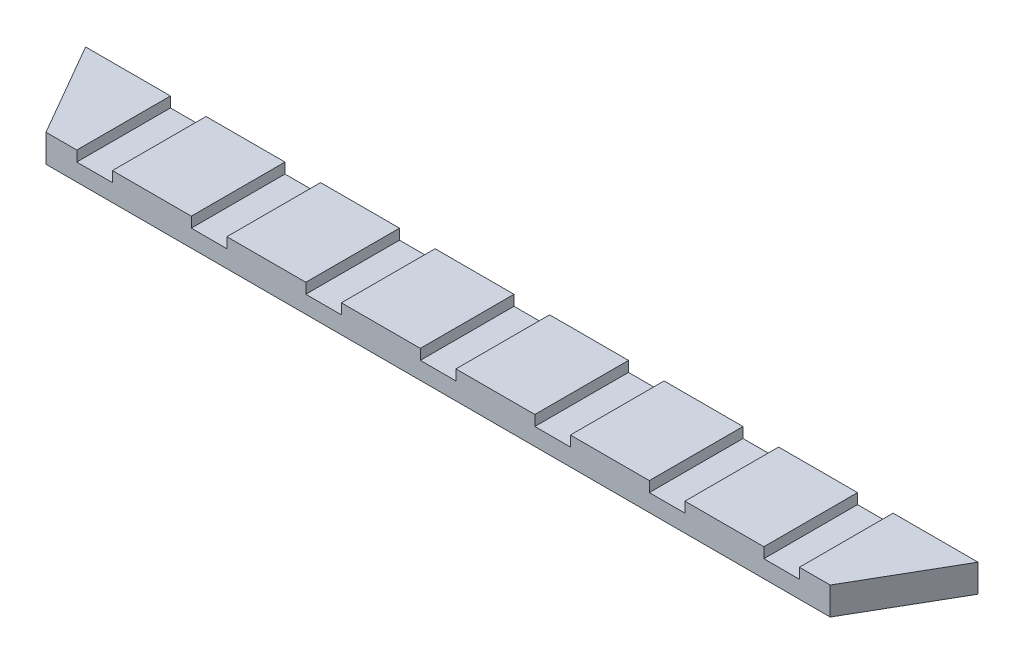
ISO-10303-21;
HEADER;
FILE_DESCRIPTION(('STEP AP214'),'2;1');
FILE_NAME('part.step','',(''),(''),'','','');
FILE_SCHEMA(('AUTOMOTIVE_DESIGN { 1 0 10303 214 1 1 1 1 }'));
ENDSEC;
DATA;
#1=APPLICATION_CONTEXT('core data for automotive mechanical design processes');
#2=APPLICATION_PROTOCOL_DEFINITION('international standard','automotive_design',2000,#1);
#3=PRODUCT_CONTEXT('',#1,'mechanical');
#4=PRODUCT('Part','Part','',(#3));
#5=PRODUCT_RELATED_PRODUCT_CATEGORY('part','',(#4));
#6=PRODUCT_DEFINITION_FORMATION('','',#4);
#7=PRODUCT_DEFINITION_CONTEXT('part definition',#1,'design');
#8=PRODUCT_DEFINITION('design','',#6,#7);
#9=PRODUCT_DEFINITION_SHAPE('','',#8);
#10=(LENGTH_UNIT() NAMED_UNIT(*) SI_UNIT(.MILLI.,.METRE.));
#11=(NAMED_UNIT(*) PLANE_ANGLE_UNIT() SI_UNIT($,.RADIAN.));
#12=(NAMED_UNIT(*) SI_UNIT($,.STERADIAN.) SOLID_ANGLE_UNIT());
#13=UNCERTAINTY_MEASURE_WITH_UNIT(LENGTH_MEASURE(1.E-05),#10,'distance_accuracy_value','');
#14=(GEOMETRIC_REPRESENTATION_CONTEXT(3) GLOBAL_UNCERTAINTY_ASSIGNED_CONTEXT((#13)) GLOBAL_UNIT_ASSIGNED_CONTEXT((#10,
#11,#12)) REPRESENTATION_CONTEXT('',''));
#15=CARTESIAN_POINT('',(0.,0.,0.));
#16=DIRECTION('',(0.,0.,1.));
#17=DIRECTION('',(1.,0.,0.));
#18=AXIS2_PLACEMENT_3D('',#15,#16,#17);
#19=CARTESIAN_POINT('',(0.,8.,0.));
#20=DIRECTION('',(0.,-1.,0.));
#21=DIRECTION('',(0.,0.,-1.));
#22=AXIS2_PLACEMENT_3D('',#19,#20,#21);
#23=PLANE('',#22);
#24=DIRECTION('',(-1.,0.,0.));
#25=VECTOR('',#24,1.);
#26=CARTESIAN_POINT('',(-128.58845726812,8.,-14.3710853800687));
#27=LINE('',#26,#25);
#28=CARTESIAN_POINT('',(-71.1291173685713,8.,-14.3710853800687));
#29=VERTEX_POINT('',#28);
#30=CARTESIAN_POINT('',(-93.8708826314287,8.,-14.3710853800687));
#31=VERTEX_POINT('',#30);
#32=EDGE_CURVE('E523',#29,#31,#27,.T.);
#33=ORIENTED_EDGE('',*,*,#32,.T.);
#34=DIRECTION('',(0.,0.,-1.));
#35=VECTOR('',#34,1.);
#36=CARTESIAN_POINT('',(-93.8708826314287,8.,-14.3710853800687));
#37=LINE('',#36,#35);
#38=CARTESIAN_POINT('',(-93.8708826314287,8.,12.6289146199313));
#39=VERTEX_POINT('',#38);
#40=EDGE_CURVE('E246',#39,#31,#37,.T.);
#41=ORIENTED_EDGE('',*,*,#40,.F.);
#42=DIRECTION('',(1.,0.,0.));
#43=VECTOR('',#42,1.);
#44=CARTESIAN_POINT('',(-113.,8.,12.6289146199313));
#45=LINE('',#44,#43);
#46=CARTESIAN_POINT('',(-71.1291173685713,8.,12.6289146199313));
#47=VERTEX_POINT('',#46);
#48=EDGE_CURVE('E449',#39,#47,#45,.T.);
#49=ORIENTED_EDGE('',*,*,#48,.T.);
#50=DIRECTION('',(0.,0.,1.));
#51=VECTOR('',#50,1.);
#52=CARTESIAN_POINT('',(-71.1291173685713,8.,-14.3710853800687));
#53=LINE('',#52,#51);
#54=EDGE_CURVE('E283',#29,#47,#53,.T.);
#55=ORIENTED_EDGE('',*,*,#54,.F.);
#56=EDGE_LOOP('',(#33,#41,#49,#55));
#57=FACE_BOUND('',#56,.T.);
#58=ADVANCED_FACE('F32',(#57),#23,.F.);
#59=CARTESIAN_POINT('',(-38.1291173685713,8.,-14.3710853800687));
#60=VERTEX_POINT('',#59);
#61=CARTESIAN_POINT('',(-60.8708826314287,8.,-14.3710853800687));
#62=VERTEX_POINT('',#61);
#63=EDGE_CURVE('E524',#60,#62,#27,.T.);
#64=ORIENTED_EDGE('',*,*,#63,.T.);
#65=DIRECTION('',(0.,0.,-1.));
#66=VECTOR('',#65,1.);
#67=CARTESIAN_POINT('',(-60.8708826314287,8.,-14.3710853800687));
#68=LINE('',#67,#66);
#69=CARTESIAN_POINT('',(-60.8708826314287,8.,12.6289146199313));
#70=VERTEX_POINT('',#69);
#71=EDGE_CURVE('E293',#70,#62,#68,.T.);
#72=ORIENTED_EDGE('',*,*,#71,.F.);
#73=CARTESIAN_POINT('',(-38.1291173685713,8.,12.6289146199313));
#74=VERTEX_POINT('',#73);
#75=EDGE_CURVE('E505',#70,#74,#45,.T.);
#76=ORIENTED_EDGE('',*,*,#75,.T.);
#77=DIRECTION('',(0.,0.,1.));
#78=VECTOR('',#77,1.);
#79=CARTESIAN_POINT('',(-38.1291173685713,8.,-14.3710853800687));
#80=LINE('',#79,#78);
#81=EDGE_CURVE('E308',#60,#74,#80,.T.);
#82=ORIENTED_EDGE('',*,*,#81,.F.);
#83=EDGE_LOOP('',(#64,#72,#76,#82));
#84=FACE_BOUND('',#83,.T.);
#85=ADVANCED_FACE('F539',(#84),#23,.F.);
#86=CARTESIAN_POINT('',(-5.1291173685713,8.,-14.3710853800687));
#87=VERTEX_POINT('',#86);
#88=CARTESIAN_POINT('',(-27.8708826314287,8.,-14.3710853800687));
#89=VERTEX_POINT('',#88);
#90=EDGE_CURVE('E526',#87,#89,#27,.T.);
#91=ORIENTED_EDGE('',*,*,#90,.T.);
#92=DIRECTION('',(0.,0.,-1.));
#93=VECTOR('',#92,1.);
#94=CARTESIAN_POINT('',(-27.8708826314287,8.,-14.3710853800687));
#95=LINE('',#94,#93);
#96=CARTESIAN_POINT('',(-27.8708826314287,8.,12.6289146199313));
#97=VERTEX_POINT('',#96);
#98=EDGE_CURVE('E318',#97,#89,#95,.T.);
#99=ORIENTED_EDGE('',*,*,#98,.F.);
#100=CARTESIAN_POINT('',(-5.1291173685713,8.,12.6289146199313));
#101=VERTEX_POINT('',#100);
#102=EDGE_CURVE('E499',#97,#101,#45,.T.);
#103=ORIENTED_EDGE('',*,*,#102,.T.);
#104=DIRECTION('',(0.,0.,1.));
#105=VECTOR('',#104,1.);
#106=CARTESIAN_POINT('',(-5.1291173685713,8.,-14.3710853800687));
#107=LINE('',#106,#105);
#108=EDGE_CURVE('E334',#87,#101,#107,.T.);
#109=ORIENTED_EDGE('',*,*,#108,.F.);
#110=EDGE_LOOP('',(#91,#99,#103,#109));
#111=FACE_BOUND('',#110,.T.);
#112=ADVANCED_FACE('F545',(#111),#23,.F.);
#113=CARTESIAN_POINT('',(27.8708826314287,8.,-14.3710853800687));
#114=VERTEX_POINT('',#113);
#115=CARTESIAN_POINT('',(5.1291173685713,8.,-14.3710853800687));
#116=VERTEX_POINT('',#115);
#117=EDGE_CURVE('E573',#114,#116,#27,.T.);
#118=ORIENTED_EDGE('',*,*,#117,.T.);
#119=DIRECTION('',(0.,0.,-1.));
#120=VECTOR('',#119,1.);
#121=CARTESIAN_POINT('',(5.1291173685713,8.,-14.3710853800687));
#122=LINE('',#121,#120);
#123=CARTESIAN_POINT('',(5.1291173685713,8.,12.6289146199313));
#124=VERTEX_POINT('',#123);
#125=EDGE_CURVE('E344',#124,#116,#122,.T.);
#126=ORIENTED_EDGE('',*,*,#125,.F.);
#127=CARTESIAN_POINT('',(27.8708826314287,8.,12.6289146199313));
#128=VERTEX_POINT('',#127);
#129=EDGE_CURVE('E493',#124,#128,#45,.T.);
#130=ORIENTED_EDGE('',*,*,#129,.T.);
#131=DIRECTION('',(0.,0.,1.));
#132=VECTOR('',#131,1.);
#133=CARTESIAN_POINT('',(27.8708826314287,8.,-14.3710853800687));
#134=LINE('',#133,#132);
#135=EDGE_CURVE('E360',#114,#128,#134,.T.);
#136=ORIENTED_EDGE('',*,*,#135,.F.);
#137=EDGE_LOOP('',(#118,#126,#130,#136));
#138=FACE_BOUND('',#137,.T.);
#139=ADVANCED_FACE('F567',(#138),#23,.F.);
#140=CARTESIAN_POINT('',(60.8708826314287,8.,-14.3710853800687));
#141=VERTEX_POINT('',#140);
#142=CARTESIAN_POINT('',(38.1291173685713,8.,-14.3710853800687));
#143=VERTEX_POINT('',#142);
#144=EDGE_CURVE('E571',#141,#143,#27,.T.);
#145=ORIENTED_EDGE('',*,*,#144,.T.);
#146=DIRECTION('',(0.,0.,-1.));
#147=VECTOR('',#146,1.);
#148=CARTESIAN_POINT('',(38.1291173685713,8.,-14.3710853800687));
#149=LINE('',#148,#147);
#150=CARTESIAN_POINT('',(38.1291173685713,8.,12.6289146199313));
#151=VERTEX_POINT('',#150);
#152=EDGE_CURVE('E370',#151,#143,#149,.T.);
#153=ORIENTED_EDGE('',*,*,#152,.F.);
#154=CARTESIAN_POINT('',(60.8708826314287,8.,12.6289146199313));
#155=VERTEX_POINT('',#154);
#156=EDGE_CURVE('E487',#151,#155,#45,.T.);
#157=ORIENTED_EDGE('',*,*,#156,.T.);
#158=DIRECTION('',(0.,0.,1.));
#159=VECTOR('',#158,1.);
#160=CARTESIAN_POINT('',(60.8708826314287,8.,-14.3710853800687));
#161=LINE('',#160,#159);
#162=EDGE_CURVE('E386',#141,#155,#161,.T.);
#163=ORIENTED_EDGE('',*,*,#162,.F.);
#164=EDGE_LOOP('',(#145,#153,#157,#163));
#165=FACE_BOUND('',#164,.T.);
#166=ADVANCED_FACE('F563',(#165),#23,.F.);
#167=CARTESIAN_POINT('',(93.8708826314287,8.,-14.3710853800687));
#168=VERTEX_POINT('',#167);
#169=CARTESIAN_POINT('',(71.1291173685713,8.,-14.3710853800687));
#170=VERTEX_POINT('',#169);
#171=EDGE_CURVE('E442',#168,#170,#27,.T.);
#172=ORIENTED_EDGE('',*,*,#171,.T.);
#173=DIRECTION('',(0.,0.,-1.));
#174=VECTOR('',#173,1.);
#175=CARTESIAN_POINT('',(71.1291173685713,8.,-14.3710853800687));
#176=LINE('',#175,#174);
#177=CARTESIAN_POINT('',(71.1291173685713,8.,12.6289146199313));
#178=VERTEX_POINT('',#177);
#179=EDGE_CURVE('E396',#178,#170,#176,.T.);
#180=ORIENTED_EDGE('',*,*,#179,.F.);
#181=CARTESIAN_POINT('',(93.8708826314287,8.,12.6289146199313));
#182=VERTEX_POINT('',#181);
#183=EDGE_CURVE('E485',#178,#182,#45,.T.);
#184=ORIENTED_EDGE('',*,*,#183,.T.);
#185=DIRECTION('',(0.,0.,1.));
#186=VECTOR('',#185,1.);
#187=CARTESIAN_POINT('',(93.8708826314287,8.,-14.3710853800687));
#188=LINE('',#187,#186);
#189=EDGE_CURVE('E412',#168,#182,#188,.T.);
#190=ORIENTED_EDGE('',*,*,#189,.F.);
#191=EDGE_LOOP('',(#172,#180,#184,#190));
#192=FACE_BOUND('',#191,.T.);
#193=ADVANCED_FACE('F557',(#192),#23,.F.);
#194=CARTESIAN_POINT('',(128.58845726812,8.,-14.3710853800687));
#195=VERTEX_POINT('',#194);
#196=CARTESIAN_POINT('',(104.129117368571,8.,-14.3710853800687));
#197=VERTEX_POINT('',#196);
#198=EDGE_CURVE('E438',#195,#197,#27,.T.);
#199=ORIENTED_EDGE('',*,*,#198,.T.);
#200=DIRECTION('',(0.,0.,-1.));
#201=VECTOR('',#200,1.);
#202=CARTESIAN_POINT('',(104.129117368571,8.,-14.3710853800687));
#203=LINE('',#202,#201);
#204=CARTESIAN_POINT('',(104.129117368571,8.,12.6289146199313));
#205=VERTEX_POINT('',#204);
#206=EDGE_CURVE('E422',#205,#197,#203,.T.);
#207=ORIENTED_EDGE('',*,*,#206,.F.);
#208=CARTESIAN_POINT('',(113.,8.,12.6289146199313));
#209=VERTEX_POINT('',#208);
#210=EDGE_CURVE('E444',#205,#209,#45,.T.);
#211=ORIENTED_EDGE('',*,*,#210,.T.);
#212=DIRECTION('',(0.499999999999998,0.,-0.86602540378444));
#213=VECTOR('',#212,1.);
#214=CARTESIAN_POINT('',(113.,8.,12.6289146199313));
#215=LINE('',#214,#213);
#216=EDGE_CURVE('E433',#209,#195,#215,.T.);
#217=ORIENTED_EDGE('',*,*,#216,.T.);
#218=EDGE_LOOP('',(#199,#207,#211,#217));
#219=FACE_BOUND('',#218,.T.);
#220=ADVANCED_FACE('F482',(#219),#23,.F.);
#221=CARTESIAN_POINT('',(113.,8.,12.6289146199313));
#222=DIRECTION('',(-0.86602540378444,0.,-0.499999999999998));
#223=DIRECTION('',(-0.499999999999998,0.,0.86602540378444));
#224=AXIS2_PLACEMENT_3D('',#221,#222,#223);
#225=PLANE('',#224);
#226=DIRECTION('',(0.499999999999998,0.,-0.86602540378444));
#227=VECTOR('',#226,1.);
#228=CARTESIAN_POINT('',(113.,0.,12.6289146199313));
#229=LINE('',#228,#227);
#230=CARTESIAN_POINT('',(113.,0.,12.6289146199313));
#231=VERTEX_POINT('',#230);
#232=CARTESIAN_POINT('',(128.58845726812,0.,-14.3710853800687));
#233=VERTEX_POINT('',#232);
#234=EDGE_CURVE('E274',#231,#233,#229,.T.);
#235=ORIENTED_EDGE('',*,*,#234,.T.);
#236=DIRECTION('',(0.,-1.,0.));
#237=VECTOR('',#236,1.);
#238=CARTESIAN_POINT('',(128.58845726812,8.,-14.3710853800687));
#239=LINE('',#238,#237);
#240=EDGE_CURVE('E11',#195,#233,#239,.T.);
#241=ORIENTED_EDGE('',*,*,#240,.F.);
#242=ORIENTED_EDGE('',*,*,#216,.F.);
#243=DIRECTION('',(0.,-1.,0.));
#244=VECTOR('',#243,1.);
#245=CARTESIAN_POINT('',(113.,8.,12.6289146199313));
#246=LINE('',#245,#244);
#247=EDGE_CURVE('E448',#209,#231,#246,.T.);
#248=ORIENTED_EDGE('',*,*,#247,.T.);
#249=EDGE_LOOP('',(#235,#241,#242,#248));
#250=FACE_BOUND('',#249,.T.);
#251=ADVANCED_FACE('F34',(#250),#225,.F.);
#252=CARTESIAN_POINT('',(-128.58845726812,8.,-14.3710853800687));
#253=DIRECTION('',(0.,0.,1.));
#254=DIRECTION('',(1.,0.,0.));
#255=AXIS2_PLACEMENT_3D('',#252,#253,#254);
#256=PLANE('',#255);
#257=DIRECTION('',(-1.,0.,0.));
#258=VECTOR('',#257,1.);
#259=CARTESIAN_POINT('',(-104.129117368571,5.,-14.3710853800687));
#260=LINE('',#259,#258);
#261=CARTESIAN_POINT('',(-93.8708826314287,5.,-14.3710853800687));
#262=VERTEX_POINT('',#261);
#263=CARTESIAN_POINT('',(-104.129117368571,5.,-14.3710853800687));
#264=VERTEX_POINT('',#263);
#265=EDGE_CURVE('E257',#262,#264,#260,.T.);
#266=ORIENTED_EDGE('',*,*,#265,.F.);
#267=DIRECTION('',(0.,1.,0.));
#268=VECTOR('',#267,1.);
#269=CARTESIAN_POINT('',(-93.8708826314287,5.,-14.3710853800687));
#270=LINE('',#269,#268);
#271=EDGE_CURVE('E240',#262,#31,#270,.T.);
#272=ORIENTED_EDGE('',*,*,#271,.T.);
#273=ORIENTED_EDGE('',*,*,#32,.F.);
#274=DIRECTION('',(0.,1.,0.));
#275=VECTOR('',#274,1.);
#276=CARTESIAN_POINT('',(-71.1291173685713,5.,-14.3710853800687));
#277=LINE('',#276,#275);
#278=CARTESIAN_POINT('',(-71.1291173685713,5.,-14.3710853800687));
#279=VERTEX_POINT('',#278);
#280=EDGE_CURVE('E55',#279,#29,#277,.T.);
#281=ORIENTED_EDGE('',*,*,#280,.F.);
#282=DIRECTION('',(-1.,0.,0.));
#283=VECTOR('',#282,1.);
#284=CARTESIAN_POINT('',(-71.1291173685713,5.,-14.3710853800687));
#285=LINE('',#284,#283);
#286=CARTESIAN_POINT('',(-60.8708826314287,5.,-14.3710853800687));
#287=VERTEX_POINT('',#286);
#288=EDGE_CURVE('E282',#287,#279,#285,.T.);
#289=ORIENTED_EDGE('',*,*,#288,.F.);
#290=DIRECTION('',(0.,1.,0.));
#291=VECTOR('',#290,1.);
#292=CARTESIAN_POINT('',(-60.8708826314287,5.,-14.3710853800687));
#293=LINE('',#292,#291);
#294=EDGE_CURVE('E292',#287,#62,#293,.T.);
#295=ORIENTED_EDGE('',*,*,#294,.T.);
#296=ORIENTED_EDGE('',*,*,#63,.F.);
#297=DIRECTION('',(0.,1.,0.));
#298=VECTOR('',#297,1.);
#299=CARTESIAN_POINT('',(-38.1291173685713,5.,-14.3710853800687));
#300=LINE('',#299,#298);
#301=CARTESIAN_POINT('',(-38.1291173685713,5.,-14.3710853800687));
#302=VERTEX_POINT('',#301);
#303=EDGE_CURVE('E326',#302,#60,#300,.T.);
#304=ORIENTED_EDGE('',*,*,#303,.F.);
#305=DIRECTION('',(-1.,0.,0.));
#306=VECTOR('',#305,1.);
#307=CARTESIAN_POINT('',(-38.1291173685713,5.,-14.3710853800687));
#308=LINE('',#307,#306);
#309=CARTESIAN_POINT('',(-27.8708826314287,5.,-14.3710853800687));
#310=VERTEX_POINT('',#309);
#311=EDGE_CURVE('E307',#310,#302,#308,.T.);
#312=ORIENTED_EDGE('',*,*,#311,.F.);
#313=DIRECTION('',(0.,1.,0.));
#314=VECTOR('',#313,1.);
#315=CARTESIAN_POINT('',(-27.8708826314287,5.,-14.3710853800687));
#316=LINE('',#315,#314);
#317=EDGE_CURVE('E317',#310,#89,#316,.T.);
#318=ORIENTED_EDGE('',*,*,#317,.T.);
#319=ORIENTED_EDGE('',*,*,#90,.F.);
#320=DIRECTION('',(0.,1.,0.));
#321=VECTOR('',#320,1.);
#322=CARTESIAN_POINT('',(-5.1291173685713,5.,-14.3710853800687));
#323=LINE('',#322,#321);
#324=CARTESIAN_POINT('',(-5.1291173685713,5.,-14.3710853800687));
#325=VERTEX_POINT('',#324);
#326=EDGE_CURVE('E352',#325,#87,#323,.T.);
#327=ORIENTED_EDGE('',*,*,#326,.F.);
#328=DIRECTION('',(-1.,0.,0.));
#329=VECTOR('',#328,1.);
#330=CARTESIAN_POINT('',(-5.1291173685713,5.,-14.3710853800687));
#331=LINE('',#330,#329);
#332=CARTESIAN_POINT('',(5.1291173685713,5.,-14.3710853800687));
#333=VERTEX_POINT('',#332);
#334=EDGE_CURVE('E333',#333,#325,#331,.T.);
#335=ORIENTED_EDGE('',*,*,#334,.F.);
#336=DIRECTION('',(0.,1.,0.));
#337=VECTOR('',#336,1.);
#338=CARTESIAN_POINT('',(5.1291173685713,5.,-14.3710853800687));
#339=LINE('',#338,#337);
#340=EDGE_CURVE('E343',#333,#116,#339,.T.);
#341=ORIENTED_EDGE('',*,*,#340,.T.);
#342=ORIENTED_EDGE('',*,*,#117,.F.);
#343=DIRECTION('',(0.,1.,0.));
#344=VECTOR('',#343,1.);
#345=CARTESIAN_POINT('',(27.8708826314287,5.,-14.3710853800687));
#346=LINE('',#345,#344);
#347=CARTESIAN_POINT('',(27.8708826314287,5.,-14.3710853800687));
#348=VERTEX_POINT('',#347);
#349=EDGE_CURVE('E378',#348,#114,#346,.T.);
#350=ORIENTED_EDGE('',*,*,#349,.F.);
#351=DIRECTION('',(-1.,0.,0.));
#352=VECTOR('',#351,1.);
#353=CARTESIAN_POINT('',(27.8708826314287,5.,-14.3710853800687));
#354=LINE('',#353,#352);
#355=CARTESIAN_POINT('',(38.1291173685713,5.,-14.3710853800687));
#356=VERTEX_POINT('',#355);
#357=EDGE_CURVE('E359',#356,#348,#354,.T.);
#358=ORIENTED_EDGE('',*,*,#357,.F.);
#359=DIRECTION('',(0.,1.,0.));
#360=VECTOR('',#359,1.);
#361=CARTESIAN_POINT('',(38.1291173685713,5.,-14.3710853800687));
#362=LINE('',#361,#360);
#363=EDGE_CURVE('E369',#356,#143,#362,.T.);
#364=ORIENTED_EDGE('',*,*,#363,.T.);
#365=ORIENTED_EDGE('',*,*,#144,.F.);
#366=DIRECTION('',(0.,1.,0.));
#367=VECTOR('',#366,1.);
#368=CARTESIAN_POINT('',(60.8708826314287,5.,-14.3710853800687));
#369=LINE('',#368,#367);
#370=CARTESIAN_POINT('',(60.8708826314287,5.,-14.3710853800687));
#371=VERTEX_POINT('',#370);
#372=EDGE_CURVE('E404',#371,#141,#369,.T.);
#373=ORIENTED_EDGE('',*,*,#372,.F.);
#374=DIRECTION('',(-1.,0.,0.));
#375=VECTOR('',#374,1.);
#376=CARTESIAN_POINT('',(60.8708826314287,5.,-14.3710853800687));
#377=LINE('',#376,#375);
#378=CARTESIAN_POINT('',(71.1291173685713,5.,-14.3710853800687));
#379=VERTEX_POINT('',#378);
#380=EDGE_CURVE('E385',#379,#371,#377,.T.);
#381=ORIENTED_EDGE('',*,*,#380,.F.);
#382=DIRECTION('',(0.,1.,0.));
#383=VECTOR('',#382,1.);
#384=CARTESIAN_POINT('',(71.1291173685713,5.,-14.3710853800687));
#385=LINE('',#384,#383);
#386=EDGE_CURVE('E395',#379,#170,#385,.T.);
#387=ORIENTED_EDGE('',*,*,#386,.T.);
#388=ORIENTED_EDGE('',*,*,#171,.F.);
#389=DIRECTION('',(0.,1.,0.));
#390=VECTOR('',#389,1.);
#391=CARTESIAN_POINT('',(93.8708826314287,5.,-14.3710853800687));
#392=LINE('',#391,#390);
#393=CARTESIAN_POINT('',(93.8708826314287,5.,-14.3710853800687));
#394=VERTEX_POINT('',#393);
#395=EDGE_CURVE('E429',#394,#168,#392,.T.);
#396=ORIENTED_EDGE('',*,*,#395,.F.);
#397=DIRECTION('',(-1.,0.,0.));
#398=VECTOR('',#397,1.);
#399=CARTESIAN_POINT('',(93.8708826314287,5.,-14.3710853800687));
#400=LINE('',#399,#398);
#401=CARTESIAN_POINT('',(104.129117368571,5.,-14.3710853800687));
#402=VERTEX_POINT('',#401);
#403=EDGE_CURVE('E411',#402,#394,#400,.T.);
#404=ORIENTED_EDGE('',*,*,#403,.F.);
#405=DIRECTION('',(0.,1.,0.));
#406=VECTOR('',#405,1.);
#407=CARTESIAN_POINT('',(104.129117368571,5.,-14.3710853800687));
#408=LINE('',#407,#406);
#409=EDGE_CURVE('E421',#402,#197,#408,.T.);
#410=ORIENTED_EDGE('',*,*,#409,.T.);
#411=ORIENTED_EDGE('',*,*,#198,.F.);
#412=ORIENTED_EDGE('',*,*,#240,.T.);
#413=DIRECTION('',(-1.,0.,0.));
#414=VECTOR('',#413,1.);
#415=CARTESIAN_POINT('',(-128.58845726812,0.,-14.3710853800687));
#416=LINE('',#415,#414);
#417=CARTESIAN_POINT('',(-128.58845726812,0.,-14.3710853800687));
#418=VERTEX_POINT('',#417);
#419=EDGE_CURVE('E452',#233,#418,#416,.T.);
#420=ORIENTED_EDGE('',*,*,#419,.T.);
#421=DIRECTION('',(0.,-1.,0.));
#422=VECTOR('',#421,1.);
#423=CARTESIAN_POINT('',(-128.58845726812,8.,-14.3710853800687));
#424=LINE('',#423,#422);
#425=CARTESIAN_POINT('',(-128.58845726812,8.,-14.3710853800687));
#426=VERTEX_POINT('',#425);
#427=EDGE_CURVE('E40',#426,#418,#424,.T.);
#428=ORIENTED_EDGE('',*,*,#427,.F.);
#429=CARTESIAN_POINT('',(-104.129117368571,8.,-14.3710853800687));
#430=VERTEX_POINT('',#429);
#431=EDGE_CURVE('E436',#430,#426,#27,.T.);
#432=ORIENTED_EDGE('',*,*,#431,.F.);
#433=DIRECTION('',(0.,1.,0.));
#434=VECTOR('',#433,1.);
#435=CARTESIAN_POINT('',(-104.129117368571,5.,-14.3710853800687));
#436=LINE('',#435,#434);
#437=EDGE_CURVE('E47',#264,#430,#436,.T.);
#438=ORIENTED_EDGE('',*,*,#437,.F.);
#439=EDGE_LOOP('',(#266,#272,#273,#281,#289,#295,#296,#304,#312,#318,#319,#327,#335,#341,#342,
#350,#358,#364,#365,#373,#381,#387,#388,#396,#404,#410,#411,#412,#420,#428,#432,#438));
#440=FACE_BOUND('',#439,.T.);
#441=ADVANCED_FACE('F262',(#440),#256,.F.);
#442=CARTESIAN_POINT('',(-113.,8.,12.6289146199313));
#443=DIRECTION('',(0.86602540378444,0.,-0.499999999999997));
#444=DIRECTION('',(-0.499999999999997,0.,-0.86602540378444));
#445=AXIS2_PLACEMENT_3D('',#442,#443,#444);
#446=PLANE('',#445);
#447=DIRECTION('',(0.499999999999997,0.,0.86602540378444));
#448=VECTOR('',#447,1.);
#449=CARTESIAN_POINT('',(-113.,0.,12.6289146199313));
#450=LINE('',#449,#448);
#451=CARTESIAN_POINT('',(-113.,0.,12.6289146199313));
#452=VERTEX_POINT('',#451);
#453=EDGE_CURVE('E454',#418,#452,#450,.T.);
#454=ORIENTED_EDGE('',*,*,#453,.T.);
#455=DIRECTION('',(0.,-1.,0.));
#456=VECTOR('',#455,1.);
#457=CARTESIAN_POINT('',(-113.,8.,12.6289146199313));
#458=LINE('',#457,#456);
#459=CARTESIAN_POINT('',(-113.,8.,12.6289146199313));
#460=VERTEX_POINT('',#459);
#461=EDGE_CURVE('E459',#460,#452,#458,.T.);
#462=ORIENTED_EDGE('',*,*,#461,.F.);
#463=DIRECTION('',(0.499999999999997,0.,0.86602540378444));
#464=VECTOR('',#463,1.);
#465=CARTESIAN_POINT('',(-113.,8.,12.6289146199313));
#466=LINE('',#465,#464);
#467=EDGE_CURVE('E441',#426,#460,#466,.T.);
#468=ORIENTED_EDGE('',*,*,#467,.F.);
#469=ORIENTED_EDGE('',*,*,#427,.T.);
#470=EDGE_LOOP('',(#454,#462,#468,#469));
#471=FACE_BOUND('',#470,.T.);
#472=ADVANCED_FACE('F466',(#471),#446,.F.);
#473=CARTESIAN_POINT('',(-113.,8.,12.6289146199313));
#474=DIRECTION('',(0.,0.,-1.));
#475=DIRECTION('',(-1.,0.,0.));
#476=AXIS2_PLACEMENT_3D('',#473,#474,#475);
#477=PLANE('',#476);
#478=ORIENTED_EDGE('',*,*,#48,.F.);
#479=DIRECTION('',(0.,1.,0.));
#480=VECTOR('',#479,1.);
#481=CARTESIAN_POINT('',(-93.8708826314287,5.,12.6289146199313));
#482=LINE('',#481,#480);
#483=CARTESIAN_POINT('',(-93.8708826314287,5.,12.6289146199313));
#484=VERTEX_POINT('',#483);
#485=EDGE_CURVE('E272',#484,#39,#482,.T.);
#486=ORIENTED_EDGE('',*,*,#485,.F.);
#487=DIRECTION('',(1.,0.,0.));
#488=VECTOR('',#487,1.);
#489=CARTESIAN_POINT('',(-104.129117368571,5.,12.6289146199313));
#490=LINE('',#489,#488);
#491=CARTESIAN_POINT('',(-104.129117368571,5.,12.6289146199313));
#492=VERTEX_POINT('',#491);
#493=EDGE_CURVE('E251',#492,#484,#490,.T.);
#494=ORIENTED_EDGE('',*,*,#493,.F.);
#495=DIRECTION('',(0.,1.,0.));
#496=VECTOR('',#495,1.);
#497=CARTESIAN_POINT('',(-104.129117368571,5.,12.6289146199313));
#498=LINE('',#497,#496);
#499=CARTESIAN_POINT('',(-104.129117368571,8.,12.6289146199313));
#500=VERTEX_POINT('',#499);
#501=EDGE_CURVE('E275',#492,#500,#498,.T.);
#502=ORIENTED_EDGE('',*,*,#501,.T.);
#503=EDGE_CURVE('E445',#460,#500,#45,.T.);
#504=ORIENTED_EDGE('',*,*,#503,.F.);
#505=ORIENTED_EDGE('',*,*,#461,.T.);
#506=DIRECTION('',(1.,0.,0.));
#507=VECTOR('',#506,1.);
#508=CARTESIAN_POINT('',(-113.,0.,12.6289146199313));
#509=LINE('',#508,#507);
#510=EDGE_CURVE('E437',#452,#231,#509,.T.);
#511=ORIENTED_EDGE('',*,*,#510,.T.);
#512=ORIENTED_EDGE('',*,*,#247,.F.);
#513=ORIENTED_EDGE('',*,*,#210,.F.);
#514=DIRECTION('',(0.,1.,0.));
#515=VECTOR('',#514,1.);
#516=CARTESIAN_POINT('',(104.129117368571,5.,12.6289146199313));
#517=LINE('',#516,#515);
#518=CARTESIAN_POINT('',(104.129117368571,5.,12.6289146199313));
#519=VERTEX_POINT('',#518);
#520=EDGE_CURVE('E398',#519,#205,#517,.T.);
#521=ORIENTED_EDGE('',*,*,#520,.F.);
#522=DIRECTION('',(1.,0.,0.));
#523=VECTOR('',#522,1.);
#524=CARTESIAN_POINT('',(93.8708826314287,5.,12.6289146199313));
#525=LINE('',#524,#523);
#526=CARTESIAN_POINT('',(93.8708826314287,5.,12.6289146199313));
#527=VERTEX_POINT('',#526);
#528=EDGE_CURVE('E418',#527,#519,#525,.T.);
#529=ORIENTED_EDGE('',*,*,#528,.F.);
#530=DIRECTION('',(0.,1.,0.));
#531=VECTOR('',#530,1.);
#532=CARTESIAN_POINT('',(93.8708826314287,5.,12.6289146199313));
#533=LINE('',#532,#531);
#534=EDGE_CURVE('E426',#527,#182,#533,.T.);
#535=ORIENTED_EDGE('',*,*,#534,.T.);
#536=ORIENTED_EDGE('',*,*,#183,.F.);
#537=DIRECTION('',(0.,1.,0.));
#538=VECTOR('',#537,1.);
#539=CARTESIAN_POINT('',(71.1291173685713,5.,12.6289146199313));
#540=LINE('',#539,#538);
#541=CARTESIAN_POINT('',(71.1291173685713,5.,12.6289146199313));
#542=VERTEX_POINT('',#541);
#543=EDGE_CURVE('E372',#542,#178,#540,.T.);
#544=ORIENTED_EDGE('',*,*,#543,.F.);
#545=DIRECTION('',(1.,0.,0.));
#546=VECTOR('',#545,1.);
#547=CARTESIAN_POINT('',(60.8708826314287,5.,12.6289146199313));
#548=LINE('',#547,#546);
#549=CARTESIAN_POINT('',(60.8708826314287,5.,12.6289146199313));
#550=VERTEX_POINT('',#549);
#551=EDGE_CURVE('E392',#550,#542,#548,.T.);
#552=ORIENTED_EDGE('',*,*,#551,.F.);
#553=DIRECTION('',(0.,1.,0.));
#554=VECTOR('',#553,1.);
#555=CARTESIAN_POINT('',(60.8708826314287,5.,12.6289146199313));
#556=LINE('',#555,#554);
#557=EDGE_CURVE('E401',#550,#155,#556,.T.);
#558=ORIENTED_EDGE('',*,*,#557,.T.);
#559=ORIENTED_EDGE('',*,*,#156,.F.);
#560=DIRECTION('',(0.,1.,0.));
#561=VECTOR('',#560,1.);
#562=CARTESIAN_POINT('',(38.1291173685713,5.,12.6289146199313));
#563=LINE('',#562,#561);
#564=CARTESIAN_POINT('',(38.1291173685713,5.,12.6289146199313));
#565=VERTEX_POINT('',#564);
#566=EDGE_CURVE('E346',#565,#151,#563,.T.);
#567=ORIENTED_EDGE('',*,*,#566,.F.);
#568=DIRECTION('',(1.,0.,0.));
#569=VECTOR('',#568,1.);
#570=CARTESIAN_POINT('',(27.8708826314287,5.,12.6289146199313));
#571=LINE('',#570,#569);
#572=CARTESIAN_POINT('',(27.8708826314287,5.,12.6289146199313));
#573=VERTEX_POINT('',#572);
#574=EDGE_CURVE('E366',#573,#565,#571,.T.);
#575=ORIENTED_EDGE('',*,*,#574,.F.);
#576=DIRECTION('',(0.,1.,0.));
#577=VECTOR('',#576,1.);
#578=CARTESIAN_POINT('',(27.8708826314287,5.,12.6289146199313));
#579=LINE('',#578,#577);
#580=EDGE_CURVE('E375',#573,#128,#579,.T.);
#581=ORIENTED_EDGE('',*,*,#580,.T.);
#582=ORIENTED_EDGE('',*,*,#129,.F.);
#583=DIRECTION('',(0.,1.,0.));
#584=VECTOR('',#583,1.);
#585=CARTESIAN_POINT('',(5.1291173685713,5.,12.6289146199313));
#586=LINE('',#585,#584);
#587=CARTESIAN_POINT('',(5.1291173685713,5.,12.6289146199313));
#588=VERTEX_POINT('',#587);
#589=EDGE_CURVE('E320',#588,#124,#586,.T.);
#590=ORIENTED_EDGE('',*,*,#589,.F.);
#591=DIRECTION('',(1.,0.,0.));
#592=VECTOR('',#591,1.);
#593=CARTESIAN_POINT('',(-5.1291173685713,5.,12.6289146199313));
#594=LINE('',#593,#592);
#595=CARTESIAN_POINT('',(-5.1291173685713,5.,12.6289146199313));
#596=VERTEX_POINT('',#595);
#597=EDGE_CURVE('E340',#596,#588,#594,.T.);
#598=ORIENTED_EDGE('',*,*,#597,.F.);
#599=DIRECTION('',(0.,1.,0.));
#600=VECTOR('',#599,1.);
#601=CARTESIAN_POINT('',(-5.1291173685713,5.,12.6289146199313));
#602=LINE('',#601,#600);
#603=EDGE_CURVE('E349',#596,#101,#602,.T.);
#604=ORIENTED_EDGE('',*,*,#603,.T.);
#605=ORIENTED_EDGE('',*,*,#102,.F.);
#606=DIRECTION('',(0.,1.,0.));
#607=VECTOR('',#606,1.);
#608=CARTESIAN_POINT('',(-27.8708826314287,5.,12.6289146199313));
#609=LINE('',#608,#607);
#610=CARTESIAN_POINT('',(-27.8708826314287,5.,12.6289146199313));
#611=VERTEX_POINT('',#610);
#612=EDGE_CURVE('E295',#611,#97,#609,.T.);
#613=ORIENTED_EDGE('',*,*,#612,.F.);
#614=DIRECTION('',(1.,0.,0.));
#615=VECTOR('',#614,1.);
#616=CARTESIAN_POINT('',(-38.1291173685713,5.,12.6289146199313));
#617=LINE('',#616,#615);
#618=CARTESIAN_POINT('',(-38.1291173685713,5.,12.6289146199313));
#619=VERTEX_POINT('',#618);
#620=EDGE_CURVE('E314',#619,#611,#617,.T.);
#621=ORIENTED_EDGE('',*,*,#620,.F.);
#622=DIRECTION('',(0.,1.,0.));
#623=VECTOR('',#622,1.);
#624=CARTESIAN_POINT('',(-38.1291173685713,5.,12.6289146199313));
#625=LINE('',#624,#623);
#626=EDGE_CURVE('E323',#619,#74,#625,.T.);
#627=ORIENTED_EDGE('',*,*,#626,.T.);
#628=ORIENTED_EDGE('',*,*,#75,.F.);
#629=DIRECTION('',(0.,1.,0.));
#630=VECTOR('',#629,1.);
#631=CARTESIAN_POINT('',(-60.8708826314287,5.,12.6289146199313));
#632=LINE('',#631,#630);
#633=CARTESIAN_POINT('',(-60.8708826314287,5.,12.6289146199313));
#634=VERTEX_POINT('',#633);
#635=EDGE_CURVE('E270',#634,#70,#632,.T.);
#636=ORIENTED_EDGE('',*,*,#635,.F.);
#637=DIRECTION('',(1.,0.,0.));
#638=VECTOR('',#637,1.);
#639=CARTESIAN_POINT('',(-71.1291173685713,5.,12.6289146199313));
#640=LINE('',#639,#638);
#641=CARTESIAN_POINT('',(-71.1291173685713,5.,12.6289146199313));
#642=VERTEX_POINT('',#641);
#643=EDGE_CURVE('E289',#642,#634,#640,.T.);
#644=ORIENTED_EDGE('',*,*,#643,.F.);
#645=DIRECTION('',(0.,1.,0.));
#646=VECTOR('',#645,1.);
#647=CARTESIAN_POINT('',(-71.1291173685713,5.,12.6289146199313));
#648=LINE('',#647,#646);
#649=EDGE_CURVE('E298',#642,#47,#648,.T.);
#650=ORIENTED_EDGE('',*,*,#649,.T.);
#651=EDGE_LOOP('',(#478,#486,#494,#502,#504,#505,#511,#512,#513,#521,#529,#535,#536,#544,#552,
#558,#559,#567,#575,#581,#582,#590,#598,#604,#605,#613,#621,#627,#628,#636,#644,#650));
#652=FACE_BOUND('',#651,.T.);
#653=ADVANCED_FACE('F475',(#652),#477,.F.);
#654=ORIENTED_EDGE('',*,*,#503,.T.);
#655=DIRECTION('',(0.,0.,1.));
#656=VECTOR('',#655,1.);
#657=CARTESIAN_POINT('',(-104.129117368571,8.,-14.3710853800687));
#658=LINE('',#657,#656);
#659=EDGE_CURVE('E260',#430,#500,#658,.T.);
#660=ORIENTED_EDGE('',*,*,#659,.F.);
#661=ORIENTED_EDGE('',*,*,#431,.T.);
#662=ORIENTED_EDGE('',*,*,#467,.T.);
#663=EDGE_LOOP('',(#654,#660,#661,#662));
#664=FACE_BOUND('',#663,.T.);
#665=ADVANCED_FACE('F528',(#664),#23,.F.);
#666=CARTESIAN_POINT('',(0.,0.,0.));
#667=DIRECTION('',(0.,-1.,0.));
#668=DIRECTION('',(0.,0.,-1.));
#669=AXIS2_PLACEMENT_3D('',#666,#667,#668);
#670=PLANE('',#669);
#671=ORIENTED_EDGE('',*,*,#234,.F.);
#672=ORIENTED_EDGE('',*,*,#510,.F.);
#673=ORIENTED_EDGE('',*,*,#453,.F.);
#674=ORIENTED_EDGE('',*,*,#419,.F.);
#675=EDGE_LOOP('',(#671,#672,#673,#674));
#676=FACE_BOUND('',#675,.T.);
#677=ADVANCED_FACE('F471',(#676),#670,.T.);
#678=CARTESIAN_POINT('',(104.129117368571,5.,-14.3710853800687));
#679=DIRECTION('',(1.,0.,0.));
#680=DIRECTION('',(0.,0.,-1.));
#681=AXIS2_PLACEMENT_3D('',#678,#679,#680);
#682=PLANE('',#681);
#683=ORIENTED_EDGE('',*,*,#206,.T.);
#684=ORIENTED_EDGE('',*,*,#409,.F.);
#685=DIRECTION('',(0.,0.,-1.));
#686=VECTOR('',#685,1.);
#687=CARTESIAN_POINT('',(104.129117368571,5.,-14.3710853800687));
#688=LINE('',#687,#686);
#689=EDGE_CURVE('E408',#519,#402,#688,.T.);
#690=ORIENTED_EDGE('',*,*,#689,.F.);
#691=ORIENTED_EDGE('',*,*,#520,.T.);
#692=EDGE_LOOP('',(#683,#684,#690,#691));
#693=FACE_BOUND('',#692,.T.);
#694=ADVANCED_FACE('F554',(#693),#682,.F.);
#695=CARTESIAN_POINT('',(93.8708826314287,5.,-14.3710853800687));
#696=DIRECTION('',(-1.,0.,0.));
#697=DIRECTION('',(0.,0.,1.));
#698=AXIS2_PLACEMENT_3D('',#695,#696,#697);
#699=PLANE('',#698);
#700=ORIENTED_EDGE('',*,*,#189,.T.);
#701=ORIENTED_EDGE('',*,*,#534,.F.);
#702=DIRECTION('',(0.,0.,1.));
#703=VECTOR('',#702,1.);
#704=CARTESIAN_POINT('',(93.8708826314287,5.,-14.3710853800687));
#705=LINE('',#704,#703);
#706=EDGE_CURVE('E415',#394,#527,#705,.T.);
#707=ORIENTED_EDGE('',*,*,#706,.F.);
#708=ORIENTED_EDGE('',*,*,#395,.T.);
#709=EDGE_LOOP('',(#700,#701,#707,#708));
#710=FACE_BOUND('',#709,.T.);
#711=ADVANCED_FACE('F619',(#710),#699,.F.);
#712=CARTESIAN_POINT('',(0.,5.,0.));
#713=DIRECTION('',(0.,1.,0.));
#714=DIRECTION('',(0.,0.,1.));
#715=AXIS2_PLACEMENT_3D('',#712,#713,#714);
#716=PLANE('',#715);
#717=ORIENTED_EDGE('',*,*,#689,.T.);
#718=ORIENTED_EDGE('',*,*,#403,.T.);
#719=ORIENTED_EDGE('',*,*,#706,.T.);
#720=ORIENTED_EDGE('',*,*,#528,.T.);
#721=EDGE_LOOP('',(#717,#718,#719,#720));
#722=FACE_BOUND('',#721,.T.);
#723=ADVANCED_FACE('F621',(#722),#716,.T.);
#724=CARTESIAN_POINT('',(71.1291173685713,5.,-14.3710853800687));
#725=DIRECTION('',(1.,0.,0.));
#726=DIRECTION('',(0.,0.,-1.));
#727=AXIS2_PLACEMENT_3D('',#724,#725,#726);
#728=PLANE('',#727);
#729=ORIENTED_EDGE('',*,*,#179,.T.);
#730=ORIENTED_EDGE('',*,*,#386,.F.);
#731=DIRECTION('',(0.,0.,-1.));
#732=VECTOR('',#731,1.);
#733=CARTESIAN_POINT('',(71.1291173685713,5.,-14.3710853800687));
#734=LINE('',#733,#732);
#735=EDGE_CURVE('E382',#542,#379,#734,.T.);
#736=ORIENTED_EDGE('',*,*,#735,.F.);
#737=ORIENTED_EDGE('',*,*,#543,.T.);
#738=EDGE_LOOP('',(#729,#730,#736,#737));
#739=FACE_BOUND('',#738,.T.);
#740=ADVANCED_FACE('F616',(#739),#728,.F.);
#741=CARTESIAN_POINT('',(60.8708826314287,5.,-14.3710853800687));
#742=DIRECTION('',(-1.,0.,0.));
#743=DIRECTION('',(0.,0.,1.));
#744=AXIS2_PLACEMENT_3D('',#741,#742,#743);
#745=PLANE('',#744);
#746=ORIENTED_EDGE('',*,*,#162,.T.);
#747=ORIENTED_EDGE('',*,*,#557,.F.);
#748=DIRECTION('',(0.,0.,1.));
#749=VECTOR('',#748,1.);
#750=CARTESIAN_POINT('',(60.8708826314287,5.,-14.3710853800687));
#751=LINE('',#750,#749);
#752=EDGE_CURVE('E389',#371,#550,#751,.T.);
#753=ORIENTED_EDGE('',*,*,#752,.F.);
#754=ORIENTED_EDGE('',*,*,#372,.T.);
#755=EDGE_LOOP('',(#746,#747,#753,#754));
#756=FACE_BOUND('',#755,.T.);
#757=ADVANCED_FACE('F611',(#756),#745,.F.);
#758=CARTESIAN_POINT('',(0.,5.,0.));
#759=DIRECTION('',(0.,1.,0.));
#760=DIRECTION('',(0.,0.,1.));
#761=AXIS2_PLACEMENT_3D('',#758,#759,#760);
#762=PLANE('',#761);
#763=ORIENTED_EDGE('',*,*,#735,.T.);
#764=ORIENTED_EDGE('',*,*,#380,.T.);
#765=ORIENTED_EDGE('',*,*,#752,.T.);
#766=ORIENTED_EDGE('',*,*,#551,.T.);
#767=EDGE_LOOP('',(#763,#764,#765,#766));
#768=FACE_BOUND('',#767,.T.);
#769=ADVANCED_FACE('F613',(#768),#762,.T.);
#770=CARTESIAN_POINT('',(38.1291173685713,5.,-14.3710853800687));
#771=DIRECTION('',(1.,0.,0.));
#772=DIRECTION('',(0.,0.,-1.));
#773=AXIS2_PLACEMENT_3D('',#770,#771,#772);
#774=PLANE('',#773);
#775=ORIENTED_EDGE('',*,*,#152,.T.);
#776=ORIENTED_EDGE('',*,*,#363,.F.);
#777=DIRECTION('',(0.,0.,-1.));
#778=VECTOR('',#777,1.);
#779=CARTESIAN_POINT('',(38.1291173685713,5.,-14.3710853800687));
#780=LINE('',#779,#778);
#781=EDGE_CURVE('E356',#565,#356,#780,.T.);
#782=ORIENTED_EDGE('',*,*,#781,.F.);
#783=ORIENTED_EDGE('',*,*,#566,.T.);
#784=EDGE_LOOP('',(#775,#776,#782,#783));
#785=FACE_BOUND('',#784,.T.);
#786=ADVANCED_FACE('F607',(#785),#774,.F.);
#787=CARTESIAN_POINT('',(27.8708826314287,5.,-14.3710853800687));
#788=DIRECTION('',(-1.,0.,0.));
#789=DIRECTION('',(0.,0.,1.));
#790=AXIS2_PLACEMENT_3D('',#787,#788,#789);
#791=PLANE('',#790);
#792=ORIENTED_EDGE('',*,*,#135,.T.);
#793=ORIENTED_EDGE('',*,*,#580,.F.);
#794=DIRECTION('',(0.,0.,1.));
#795=VECTOR('',#794,1.);
#796=CARTESIAN_POINT('',(27.8708826314287,5.,-14.3710853800687));
#797=LINE('',#796,#795);
#798=EDGE_CURVE('E363',#348,#573,#797,.T.);
#799=ORIENTED_EDGE('',*,*,#798,.F.);
#800=ORIENTED_EDGE('',*,*,#349,.T.);
#801=EDGE_LOOP('',(#792,#793,#799,#800));
#802=FACE_BOUND('',#801,.T.);
#803=ADVANCED_FACE('F601',(#802),#791,.F.);
#804=CARTESIAN_POINT('',(0.,5.,0.));
#805=DIRECTION('',(0.,1.,0.));
#806=DIRECTION('',(0.,0.,1.));
#807=AXIS2_PLACEMENT_3D('',#804,#805,#806);
#808=PLANE('',#807);
#809=ORIENTED_EDGE('',*,*,#781,.T.);
#810=ORIENTED_EDGE('',*,*,#357,.T.);
#811=ORIENTED_EDGE('',*,*,#798,.T.);
#812=ORIENTED_EDGE('',*,*,#574,.T.);
#813=EDGE_LOOP('',(#809,#810,#811,#812));
#814=FACE_BOUND('',#813,.T.);
#815=ADVANCED_FACE('F603',(#814),#808,.T.);
#816=CARTESIAN_POINT('',(5.1291173685713,5.,-14.3710853800687));
#817=DIRECTION('',(1.,0.,0.));
#818=DIRECTION('',(0.,0.,-1.));
#819=AXIS2_PLACEMENT_3D('',#816,#817,#818);
#820=PLANE('',#819);
#821=ORIENTED_EDGE('',*,*,#125,.T.);
#822=ORIENTED_EDGE('',*,*,#340,.F.);
#823=DIRECTION('',(0.,0.,-1.));
#824=VECTOR('',#823,1.);
#825=CARTESIAN_POINT('',(5.1291173685713,5.,-14.3710853800687));
#826=LINE('',#825,#824);
#827=EDGE_CURVE('E330',#588,#333,#826,.T.);
#828=ORIENTED_EDGE('',*,*,#827,.F.);
#829=ORIENTED_EDGE('',*,*,#589,.T.);
#830=EDGE_LOOP('',(#821,#822,#828,#829));
#831=FACE_BOUND('',#830,.T.);
#832=ADVANCED_FACE('F597',(#831),#820,.F.);
#833=CARTESIAN_POINT('',(-5.1291173685713,5.,-14.3710853800687));
#834=DIRECTION('',(-1.,0.,0.));
#835=DIRECTION('',(0.,0.,1.));
#836=AXIS2_PLACEMENT_3D('',#833,#834,#835);
#837=PLANE('',#836);
#838=ORIENTED_EDGE('',*,*,#108,.T.);
#839=ORIENTED_EDGE('',*,*,#603,.F.);
#840=DIRECTION('',(0.,0.,1.));
#841=VECTOR('',#840,1.);
#842=CARTESIAN_POINT('',(-5.1291173685713,5.,-14.3710853800687));
#843=LINE('',#842,#841);
#844=EDGE_CURVE('E337',#325,#596,#843,.T.);
#845=ORIENTED_EDGE('',*,*,#844,.F.);
#846=ORIENTED_EDGE('',*,*,#326,.T.);
#847=EDGE_LOOP('',(#838,#839,#845,#846));
#848=FACE_BOUND('',#847,.T.);
#849=ADVANCED_FACE('F592',(#848),#837,.F.);
#850=CARTESIAN_POINT('',(0.,5.,0.));
#851=DIRECTION('',(0.,1.,0.));
#852=DIRECTION('',(0.,0.,1.));
#853=AXIS2_PLACEMENT_3D('',#850,#851,#852);
#854=PLANE('',#853);
#855=ORIENTED_EDGE('',*,*,#827,.T.);
#856=ORIENTED_EDGE('',*,*,#334,.T.);
#857=ORIENTED_EDGE('',*,*,#844,.T.);
#858=ORIENTED_EDGE('',*,*,#597,.T.);
#859=EDGE_LOOP('',(#855,#856,#857,#858));
#860=FACE_BOUND('',#859,.T.);
#861=ADVANCED_FACE('F594',(#860),#854,.T.);
#862=CARTESIAN_POINT('',(-27.8708826314287,5.,-14.3710853800687));
#863=DIRECTION('',(1.,0.,0.));
#864=DIRECTION('',(0.,0.,-1.));
#865=AXIS2_PLACEMENT_3D('',#862,#863,#864);
#866=PLANE('',#865);
#867=ORIENTED_EDGE('',*,*,#98,.T.);
#868=ORIENTED_EDGE('',*,*,#317,.F.);
#869=DIRECTION('',(0.,0.,-1.));
#870=VECTOR('',#869,1.);
#871=CARTESIAN_POINT('',(-27.8708826314287,5.,-14.3710853800687));
#872=LINE('',#871,#870);
#873=EDGE_CURVE('E304',#611,#310,#872,.T.);
#874=ORIENTED_EDGE('',*,*,#873,.F.);
#875=ORIENTED_EDGE('',*,*,#612,.T.);
#876=EDGE_LOOP('',(#867,#868,#874,#875));
#877=FACE_BOUND('',#876,.T.);
#878=ADVANCED_FACE('F584',(#877),#866,.F.);
#879=CARTESIAN_POINT('',(-38.1291173685713,5.,-14.3710853800687));
#880=DIRECTION('',(-1.,0.,0.));
#881=DIRECTION('',(0.,0.,1.));
#882=AXIS2_PLACEMENT_3D('',#879,#880,#881);
#883=PLANE('',#882);
#884=ORIENTED_EDGE('',*,*,#81,.T.);
#885=ORIENTED_EDGE('',*,*,#626,.F.);
#886=DIRECTION('',(0.,0.,1.));
#887=VECTOR('',#886,1.);
#888=CARTESIAN_POINT('',(-38.1291173685713,5.,-14.3710853800687));
#889=LINE('',#888,#887);
#890=EDGE_CURVE('E311',#302,#619,#889,.T.);
#891=ORIENTED_EDGE('',*,*,#890,.F.);
#892=ORIENTED_EDGE('',*,*,#303,.T.);
#893=EDGE_LOOP('',(#884,#885,#891,#892));
#894=FACE_BOUND('',#893,.T.);
#895=ADVANCED_FACE('F652',(#894),#883,.F.);
#896=CARTESIAN_POINT('',(0.,5.,0.));
#897=DIRECTION('',(0.,1.,0.));
#898=DIRECTION('',(0.,0.,1.));
#899=AXIS2_PLACEMENT_3D('',#896,#897,#898);
#900=PLANE('',#899);
#901=ORIENTED_EDGE('',*,*,#873,.T.);
#902=ORIENTED_EDGE('',*,*,#311,.T.);
#903=ORIENTED_EDGE('',*,*,#890,.T.);
#904=ORIENTED_EDGE('',*,*,#620,.T.);
#905=EDGE_LOOP('',(#901,#902,#903,#904));
#906=FACE_BOUND('',#905,.T.);
#907=ADVANCED_FACE('F586',(#906),#900,.T.);
#908=CARTESIAN_POINT('',(-60.8708826314287,5.,-14.3710853800687));
#909=DIRECTION('',(1.,0.,0.));
#910=DIRECTION('',(0.,0.,-1.));
#911=AXIS2_PLACEMENT_3D('',#908,#909,#910);
#912=PLANE('',#911);
#913=ORIENTED_EDGE('',*,*,#71,.T.);
#914=ORIENTED_EDGE('',*,*,#294,.F.);
#915=DIRECTION('',(0.,0.,-1.));
#916=VECTOR('',#915,1.);
#917=CARTESIAN_POINT('',(-60.8708826314287,5.,-14.3710853800687));
#918=LINE('',#917,#916);
#919=EDGE_CURVE('E279',#634,#287,#918,.T.);
#920=ORIENTED_EDGE('',*,*,#919,.F.);
#921=ORIENTED_EDGE('',*,*,#635,.T.);
#922=EDGE_LOOP('',(#913,#914,#920,#921));
#923=FACE_BOUND('',#922,.T.);
#924=ADVANCED_FACE('F658',(#923),#912,.F.);
#925=CARTESIAN_POINT('',(-71.1291173685713,5.,-14.3710853800687));
#926=DIRECTION('',(-1.,0.,0.));
#927=DIRECTION('',(0.,0.,1.));
#928=AXIS2_PLACEMENT_3D('',#925,#926,#927);
#929=PLANE('',#928);
#930=ORIENTED_EDGE('',*,*,#54,.T.);
#931=ORIENTED_EDGE('',*,*,#649,.F.);
#932=DIRECTION('',(0.,0.,1.));
#933=VECTOR('',#932,1.);
#934=CARTESIAN_POINT('',(-71.1291173685713,5.,-14.3710853800687));
#935=LINE('',#934,#933);
#936=EDGE_CURVE('E286',#279,#642,#935,.T.);
#937=ORIENTED_EDGE('',*,*,#936,.F.);
#938=ORIENTED_EDGE('',*,*,#280,.T.);
#939=EDGE_LOOP('',(#930,#931,#937,#938));
#940=FACE_BOUND('',#939,.T.);
#941=ADVANCED_FACE('F519',(#940),#929,.F.);
#942=CARTESIAN_POINT('',(0.,5.,0.));
#943=DIRECTION('',(0.,1.,0.));
#944=DIRECTION('',(0.,0.,1.));
#945=AXIS2_PLACEMENT_3D('',#942,#943,#944);
#946=PLANE('',#945);
#947=ORIENTED_EDGE('',*,*,#919,.T.);
#948=ORIENTED_EDGE('',*,*,#288,.T.);
#949=ORIENTED_EDGE('',*,*,#936,.T.);
#950=ORIENTED_EDGE('',*,*,#643,.T.);
#951=EDGE_LOOP('',(#947,#948,#949,#950));
#952=FACE_BOUND('',#951,.T.);
#953=ADVANCED_FACE('F521',(#952),#946,.T.);
#954=CARTESIAN_POINT('',(-93.8708826314287,5.,-14.3710853800687));
#955=DIRECTION('',(1.,0.,0.));
#956=DIRECTION('',(0.,0.,-1.));
#957=AXIS2_PLACEMENT_3D('',#954,#955,#956);
#958=PLANE('',#957);
#959=ORIENTED_EDGE('',*,*,#40,.T.);
#960=ORIENTED_EDGE('',*,*,#271,.F.);
#961=DIRECTION('',(0.,0.,-1.));
#962=VECTOR('',#961,1.);
#963=CARTESIAN_POINT('',(-93.8708826314287,5.,-14.3710853800687));
#964=LINE('',#963,#962);
#965=EDGE_CURVE('E243',#484,#262,#964,.T.);
#966=ORIENTED_EDGE('',*,*,#965,.F.);
#967=ORIENTED_EDGE('',*,*,#485,.T.);
#968=EDGE_LOOP('',(#959,#960,#966,#967));
#969=FACE_BOUND('',#968,.T.);
#970=ADVANCED_FACE('F242',(#969),#958,.F.);
#971=CARTESIAN_POINT('',(-104.129117368571,5.,-14.3710853800687));
#972=DIRECTION('',(-1.,0.,0.));
#973=DIRECTION('',(0.,0.,1.));
#974=AXIS2_PLACEMENT_3D('',#971,#972,#973);
#975=PLANE('',#974);
#976=ORIENTED_EDGE('',*,*,#659,.T.);
#977=ORIENTED_EDGE('',*,*,#501,.F.);
#978=DIRECTION('',(0.,0.,1.));
#979=VECTOR('',#978,1.);
#980=CARTESIAN_POINT('',(-104.129117368571,5.,-14.3710853800687));
#981=LINE('',#980,#979);
#982=EDGE_CURVE('E264',#264,#492,#981,.T.);
#983=ORIENTED_EDGE('',*,*,#982,.F.);
#984=ORIENTED_EDGE('',*,*,#437,.T.);
#985=EDGE_LOOP('',(#976,#977,#983,#984));
#986=FACE_BOUND('',#985,.T.);
#987=ADVANCED_FACE('F529',(#986),#975,.F.);
#988=CARTESIAN_POINT('',(0.,5.,0.));
#989=DIRECTION('',(0.,1.,0.));
#990=DIRECTION('',(0.,0.,1.));
#991=AXIS2_PLACEMENT_3D('',#988,#989,#990);
#992=PLANE('',#991);
#993=ORIENTED_EDGE('',*,*,#965,.T.);
#994=ORIENTED_EDGE('',*,*,#265,.T.);
#995=ORIENTED_EDGE('',*,*,#982,.T.);
#996=ORIENTED_EDGE('',*,*,#493,.T.);
#997=EDGE_LOOP('',(#993,#994,#995,#996));
#998=FACE_BOUND('',#997,.T.);
#999=ADVANCED_FACE('F255',(#998),#992,.T.);
#1000=CLOSED_SHELL('',(#58,#85,#112,#139,#166,#193,#220,#251,#441,#472,#653,#665,#677,#694,#711,
#723,#740,#757,#769,#786,#803,#815,#832,#849,#861,#878,#895,#907,#924,#941,#953,#970,#987,#999));
#1001=MANIFOLD_SOLID_BREP('B2',#1000);
#1002=ADVANCED_BREP_SHAPE_REPRESENTATION('',(#18,#1001),#14);
#1003=SHAPE_DEFINITION_REPRESENTATION(#9,#1002);
ENDSEC;
END-ISO-10303-21;
